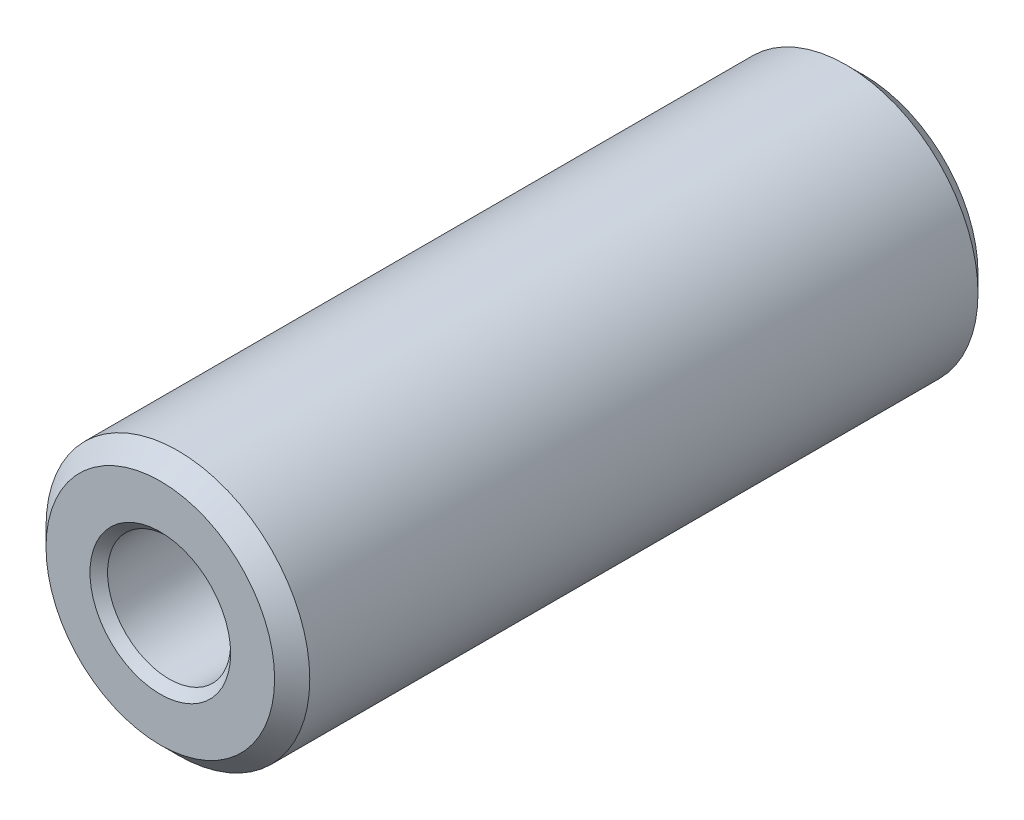
ISO-10303-21;
HEADER;
FILE_DESCRIPTION(('STEP AP214'),'2;1');
FILE_NAME('part.step','',(''),(''),'','','');
FILE_SCHEMA(('AUTOMOTIVE_DESIGN { 1 0 10303 214 1 1 1 1 }'));
ENDSEC;
DATA;
#1=APPLICATION_CONTEXT('core data for automotive mechanical design processes');
#2=APPLICATION_PROTOCOL_DEFINITION('international standard','automotive_design',2000,#1);
#3=PRODUCT_CONTEXT('',#1,'mechanical');
#4=PRODUCT('Part','Part','',(#3));
#5=PRODUCT_RELATED_PRODUCT_CATEGORY('part','',(#4));
#6=PRODUCT_DEFINITION_FORMATION('','',#4);
#7=PRODUCT_DEFINITION_CONTEXT('part definition',#1,'design');
#8=PRODUCT_DEFINITION('design','',#6,#7);
#9=PRODUCT_DEFINITION_SHAPE('','',#8);
#10=(LENGTH_UNIT() NAMED_UNIT(*) SI_UNIT(.MILLI.,.METRE.));
#11=(NAMED_UNIT(*) PLANE_ANGLE_UNIT() SI_UNIT($,.RADIAN.));
#12=(NAMED_UNIT(*) SI_UNIT($,.STERADIAN.) SOLID_ANGLE_UNIT());
#13=UNCERTAINTY_MEASURE_WITH_UNIT(LENGTH_MEASURE(1.E-05),#10,'distance_accuracy_value','');
#14=(GEOMETRIC_REPRESENTATION_CONTEXT(3) GLOBAL_UNCERTAINTY_ASSIGNED_CONTEXT((#13)) GLOBAL_UNIT_ASSIGNED_CONTEXT((#10,
#11,#12)) REPRESENTATION_CONTEXT('',''));
#15=CARTESIAN_POINT('',(0.,0.,0.));
#16=DIRECTION('',(0.,0.,1.));
#17=DIRECTION('',(1.,0.,0.));
#18=AXIS2_PLACEMENT_3D('',#15,#16,#17);
#19=CARTESIAN_POINT('',(0.,0.,80.));
#20=DIRECTION('',(0.,0.,1.));
#21=DIRECTION('',(1.,0.,0.));
#22=AXIS2_PLACEMENT_3D('',#19,#20,#21);
#23=PLANE('',#22);
#24=CARTESIAN_POINT('',(0.,0.,80.));
#25=DIRECTION('',(0.,0.,1.));
#26=DIRECTION('',(1.,0.,0.));
#27=AXIS2_PLACEMENT_3D('',#24,#25,#26);
#28=CIRCLE('',#27,13.);
#29=CARTESIAN_POINT('',(13.,0.,80.));
#30=VERTEX_POINT('',#29);
#31=EDGE_CURVE('E12',#30,#30,#28,.T.);
#32=ORIENTED_EDGE('',*,*,#31,.T.);
#33=EDGE_LOOP('',(#32));
#34=FACE_BOUND('',#33,.T.);
#35=CARTESIAN_POINT('',(0.,0.,80.));
#36=DIRECTION('',(0.,0.,1.));
#37=DIRECTION('',(1.,0.,0.));
#38=AXIS2_PLACEMENT_3D('',#35,#36,#37);
#39=CIRCLE('',#38,7.99999999999999);
#40=CARTESIAN_POINT('',(7.99999999999999,0.,80.));
#41=VERTEX_POINT('',#40);
#42=EDGE_CURVE('E67',#41,#41,#39,.F.);
#43=ORIENTED_EDGE('',*,*,#42,.T.);
#44=EDGE_LOOP('',(#43));
#45=FACE_BOUND('',#44,.T.);
#46=ADVANCED_FACE('F47',(#34,#45),#23,.T.);
#47=CARTESIAN_POINT('',(0.,0.,0.));
#48=DIRECTION('',(0.,0.,1.));
#49=DIRECTION('',(1.,0.,0.));
#50=AXIS2_PLACEMENT_3D('',#47,#48,#49);
#51=PLANE('',#50);
#52=CARTESIAN_POINT('',(0.,0.,0.));
#53=DIRECTION('',(0.,0.,1.));
#54=DIRECTION('',(1.,0.,0.));
#55=AXIS2_PLACEMENT_3D('',#52,#53,#54);
#56=CIRCLE('',#55,13.);
#57=CARTESIAN_POINT('',(13.,0.,0.));
#58=VERTEX_POINT('',#57);
#59=EDGE_CURVE('E54',#58,#58,#56,.F.);
#60=ORIENTED_EDGE('',*,*,#59,.T.);
#61=EDGE_LOOP('',(#60));
#62=FACE_BOUND('',#61,.T.);
#63=CARTESIAN_POINT('',(0.,0.,0.));
#64=DIRECTION('',(0.,0.,1.));
#65=DIRECTION('',(1.,0.,0.));
#66=AXIS2_PLACEMENT_3D('',#63,#64,#65);
#67=CIRCLE('',#66,8.00000000000001);
#68=CARTESIAN_POINT('',(8.00000000000001,0.,0.));
#69=VERTEX_POINT('',#68);
#70=EDGE_CURVE('E76',#69,#69,#67,.T.);
#71=ORIENTED_EDGE('',*,*,#70,.T.);
#72=EDGE_LOOP('',(#71));
#73=FACE_BOUND('',#72,.T.);
#74=ADVANCED_FACE('F80',(#62,#73),#51,.F.);
#75=CARTESIAN_POINT('',(0.,0.,80.));
#76=DIRECTION('',(0.,0.,-1.));
#77=DIRECTION('',(-1.,0.,0.));
#78=AXIS2_PLACEMENT_3D('',#75,#76,#77);
#79=CYLINDRICAL_SURFACE('',#78,15.);
#80=CARTESIAN_POINT('',(0.,0.,2.));
#81=DIRECTION('',(0.,0.,1.));
#82=DIRECTION('',(1.,0.,0.));
#83=AXIS2_PLACEMENT_3D('',#80,#81,#82);
#84=CIRCLE('',#83,15.);
#85=CARTESIAN_POINT('',(15.,0.,2.));
#86=VERTEX_POINT('',#85);
#87=EDGE_CURVE('E58',#86,#86,#84,.T.);
#88=ORIENTED_EDGE('',*,*,#87,.T.);
#89=EDGE_LOOP('',(#88));
#90=FACE_BOUND('',#89,.T.);
#91=CARTESIAN_POINT('',(0.,0.,78.));
#92=DIRECTION('',(0.,0.,1.));
#93=DIRECTION('',(1.,0.,0.));
#94=AXIS2_PLACEMENT_3D('',#91,#92,#93);
#95=CIRCLE('',#94,15.);
#96=CARTESIAN_POINT('',(15.,0.,78.));
#97=VERTEX_POINT('',#96);
#98=EDGE_CURVE('E62',#97,#97,#95,.F.);
#99=ORIENTED_EDGE('',*,*,#98,.T.);
#100=EDGE_LOOP('',(#99));
#101=FACE_BOUND('',#100,.T.);
#102=ADVANCED_FACE('F95',(#90,#101),#79,.T.);
#103=CARTESIAN_POINT('',(0.,0.,80.));
#104=DIRECTION('',(0.,0.,-1.));
#105=DIRECTION('',(-1.,0.,0.));
#106=AXIS2_PLACEMENT_3D('',#103,#104,#105);
#107=CYLINDRICAL_SURFACE('',#106,7.);
#108=CARTESIAN_POINT('',(0.,0.,1.00000000000001));
#109=DIRECTION('',(0.,0.,1.));
#110=DIRECTION('',(1.,0.,0.));
#111=AXIS2_PLACEMENT_3D('',#108,#109,#110);
#112=CIRCLE('',#111,7.);
#113=CARTESIAN_POINT('',(7.,0.,1.00000000000001));
#114=VERTEX_POINT('',#113);
#115=EDGE_CURVE('E70',#114,#114,#112,.F.);
#116=ORIENTED_EDGE('',*,*,#115,.T.);
#117=EDGE_LOOP('',(#116));
#118=FACE_BOUND('',#117,.T.);
#119=CARTESIAN_POINT('',(0.,0.,79.));
#120=DIRECTION('',(0.,0.,1.));
#121=DIRECTION('',(1.,0.,0.));
#122=AXIS2_PLACEMENT_3D('',#119,#120,#121);
#123=CIRCLE('',#122,7.);
#124=CARTESIAN_POINT('',(7.,0.,79.));
#125=VERTEX_POINT('',#124);
#126=EDGE_CURVE('E73',#125,#125,#123,.T.);
#127=ORIENTED_EDGE('',*,*,#126,.T.);
#128=EDGE_LOOP('',(#127));
#129=FACE_BOUND('',#128,.T.);
#130=ADVANCED_FACE('F85',(#118,#129),#107,.F.);
#131=CARTESIAN_POINT('',(0.,0.,0.));
#132=DIRECTION('',(0.,0.,-1.));
#133=DIRECTION('',(-1.,0.,0.));
#134=AXIS2_PLACEMENT_3D('',#131,#132,#133);
#135=CONICAL_SURFACE('',#134,8.00000000000001,0.785398163397445);
#136=ORIENTED_EDGE('',*,*,#115,.F.);
#137=EDGE_LOOP('',(#136));
#138=FACE_BOUND('',#137,.T.);
#139=ORIENTED_EDGE('',*,*,#70,.F.);
#140=EDGE_LOOP('',(#139));
#141=FACE_BOUND('',#140,.T.);
#142=ADVANCED_FACE('F82',(#138,#141),#135,.F.);
#143=CARTESIAN_POINT('',(0.,0.,79.));
#144=DIRECTION('',(0.,0.,1.));
#145=DIRECTION('',(1.,0.,0.));
#146=AXIS2_PLACEMENT_3D('',#143,#144,#145);
#147=CONICAL_SURFACE('',#146,7.,0.785398163397444);
#148=ORIENTED_EDGE('',*,*,#42,.F.);
#149=EDGE_LOOP('',(#148));
#150=FACE_BOUND('',#149,.T.);
#151=ORIENTED_EDGE('',*,*,#126,.F.);
#152=EDGE_LOOP('',(#151));
#153=FACE_BOUND('',#152,.T.);
#154=ADVANCED_FACE('F84',(#150,#153),#147,.F.);
#155=CARTESIAN_POINT('',(0.,0.,2.));
#156=DIRECTION('',(0.,0.,1.));
#157=DIRECTION('',(1.,0.,0.));
#158=AXIS2_PLACEMENT_3D('',#155,#156,#157);
#159=CONICAL_SURFACE('',#158,15.,0.78539816339745);
#160=ORIENTED_EDGE('',*,*,#59,.F.);
#161=EDGE_LOOP('',(#160));
#162=FACE_BOUND('',#161,.T.);
#163=ORIENTED_EDGE('',*,*,#87,.F.);
#164=EDGE_LOOP('',(#163));
#165=FACE_BOUND('',#164,.T.);
#166=ADVANCED_FACE('F92',(#162,#165),#159,.T.);
#167=CARTESIAN_POINT('',(0.,0.,80.));
#168=DIRECTION('',(0.,0.,-1.));
#169=DIRECTION('',(-1.,0.,0.));
#170=AXIS2_PLACEMENT_3D('',#167,#168,#169);
#171=CONICAL_SURFACE('',#170,13.,0.785398163397449);
#172=ORIENTED_EDGE('',*,*,#98,.F.);
#173=EDGE_LOOP('',(#172));
#174=FACE_BOUND('',#173,.T.);
#175=ORIENTED_EDGE('',*,*,#31,.F.);
#176=EDGE_LOOP('',(#175));
#177=FACE_BOUND('',#176,.T.);
#178=ADVANCED_FACE('F49',(#174,#177),#171,.T.);
#179=CLOSED_SHELL('',(#46,#74,#102,#130,#142,#154,#166,#178));
#180=MANIFOLD_SOLID_BREP('B2',#179);
#181=ADVANCED_BREP_SHAPE_REPRESENTATION('',(#18,#180),#14);
#182=SHAPE_DEFINITION_REPRESENTATION(#9,#181);
ENDSEC;
END-ISO-10303-21;
